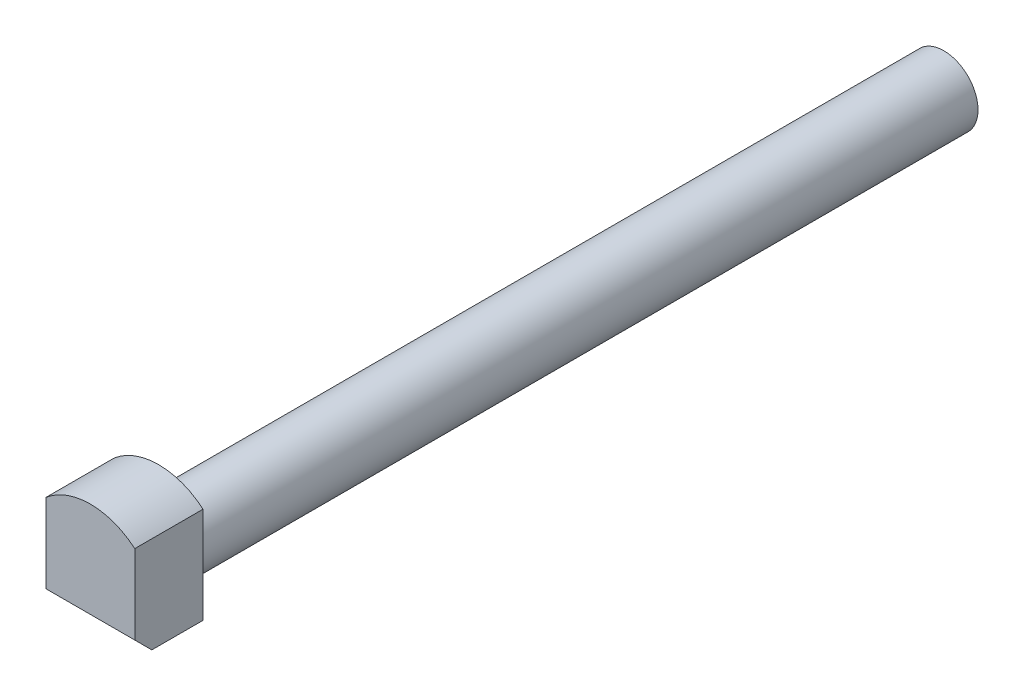
ISO-10303-21;
HEADER;
FILE_DESCRIPTION(('STEP AP214'),'2;1');
FILE_NAME('part.step','',(''),(''),'','','');
FILE_SCHEMA(('AUTOMOTIVE_DESIGN { 1 0 10303 214 1 1 1 1 }'));
ENDSEC;
DATA;
#1=APPLICATION_CONTEXT('core data for automotive mechanical design processes');
#2=APPLICATION_PROTOCOL_DEFINITION('international standard','automotive_design',2000,#1);
#3=PRODUCT_CONTEXT('',#1,'mechanical');
#4=PRODUCT('Part','Part','',(#3));
#5=PRODUCT_RELATED_PRODUCT_CATEGORY('part','',(#4));
#6=PRODUCT_DEFINITION_FORMATION('','',#4);
#7=PRODUCT_DEFINITION_CONTEXT('part definition',#1,'design');
#8=PRODUCT_DEFINITION('design','',#6,#7);
#9=PRODUCT_DEFINITION_SHAPE('','',#8);
#10=(LENGTH_UNIT() NAMED_UNIT(*) SI_UNIT(.MILLI.,.METRE.));
#11=(NAMED_UNIT(*) PLANE_ANGLE_UNIT() SI_UNIT($,.RADIAN.));
#12=(NAMED_UNIT(*) SI_UNIT($,.STERADIAN.) SOLID_ANGLE_UNIT());
#13=UNCERTAINTY_MEASURE_WITH_UNIT(LENGTH_MEASURE(1.E-05),#10,'distance_accuracy_value','');
#14=(GEOMETRIC_REPRESENTATION_CONTEXT(3) GLOBAL_UNCERTAINTY_ASSIGNED_CONTEXT((#13)) GLOBAL_UNIT_ASSIGNED_CONTEXT((#10,
#11,#12)) REPRESENTATION_CONTEXT('',''));
#15=CARTESIAN_POINT('',(0.,0.,0.));
#16=DIRECTION('',(0.,0.,1.));
#17=DIRECTION('',(1.,0.,0.));
#18=AXIS2_PLACEMENT_3D('',#15,#16,#17);
#19=CARTESIAN_POINT('',(0.,1.35,-13.8284271247462));
#20=DIRECTION('',(0.,0.,1.));
#21=DIRECTION('',(1.,0.,0.));
#22=AXIS2_PLACEMENT_3D('',#19,#20,#21);
#23=CYLINDRICAL_SURFACE('',#22,1.);
#24=CARTESIAN_POINT('',(0.,1.35,16.5));
#25=DIRECTION('',(0.,0.,1.));
#26=DIRECTION('',(1.,0.,0.));
#27=AXIS2_PLACEMENT_3D('',#24,#25,#26);
#28=CIRCLE('',#27,1.);
#29=CARTESIAN_POINT('',(1.,1.35,16.5));
#30=VERTEX_POINT('',#29);
#31=EDGE_CURVE('E108',#30,#30,#28,.T.);
#32=ORIENTED_EDGE('',*,*,#31,.F.);
#33=EDGE_LOOP('',(#32));
#34=FACE_BOUND('',#33,.T.);
#35=CARTESIAN_POINT('',(0.,1.35,-6.5));
#36=DIRECTION('',(0.,0.,-1.));
#37=DIRECTION('',(-1.,0.,0.));
#38=AXIS2_PLACEMENT_3D('',#35,#36,#37);
#39=CIRCLE('',#38,1.);
#40=CARTESIAN_POINT('',(-1.,1.35,-6.5));
#41=VERTEX_POINT('',#40);
#42=EDGE_CURVE('E134',#41,#41,#39,.T.);
#43=ORIENTED_EDGE('',*,*,#42,.F.);
#44=EDGE_LOOP('',(#43));
#45=FACE_BOUND('',#44,.T.);
#46=ADVANCED_FACE('F36',(#34,#45),#23,.T.);
#47=CARTESIAN_POINT('',(0.,1.35,18.5));
#48=DIRECTION('',(0.,0.,-1.));
#49=DIRECTION('',(-1.,0.,0.));
#50=AXIS2_PLACEMENT_3D('',#47,#48,#49);
#51=CYLINDRICAL_SURFACE('',#50,2.);
#52=DIRECTION('',(0.,0.,1.));
#53=VECTOR('',#52,1.);
#54=CARTESIAN_POINT('',(1.3,2.86986841535707,-11.));
#55=LINE('',#54,#53);
#56=CARTESIAN_POINT('',(1.3,2.86986841535707,16.5));
#57=VERTEX_POINT('',#56);
#58=CARTESIAN_POINT('',(1.3,2.86986841535707,18.5));
#59=VERTEX_POINT('',#58);
#60=EDGE_CURVE('E96',#57,#59,#55,.T.);
#61=ORIENTED_EDGE('',*,*,#60,.F.);
#62=CARTESIAN_POINT('',(0.,1.35,16.5));
#63=DIRECTION('',(0.,0.,1.));
#64=DIRECTION('',(1.,0.,0.));
#65=AXIS2_PLACEMENT_3D('',#62,#63,#64);
#66=CIRCLE('',#65,2.);
#67=CARTESIAN_POINT('',(-1.3,2.86986841535707,16.5));
#68=VERTEX_POINT('',#67);
#69=EDGE_CURVE('E103',#57,#68,#66,.T.);
#70=ORIENTED_EDGE('',*,*,#69,.T.);
#71=DIRECTION('',(0.,0.,1.));
#72=VECTOR('',#71,1.);
#73=CARTESIAN_POINT('',(-1.3,2.86986841535707,-11.));
#74=LINE('',#73,#72);
#75=CARTESIAN_POINT('',(-1.3,2.86986841535707,18.5));
#76=VERTEX_POINT('',#75);
#77=EDGE_CURVE('E92',#68,#76,#74,.T.);
#78=ORIENTED_EDGE('',*,*,#77,.T.);
#79=CARTESIAN_POINT('',(0.,1.35,18.5));
#80=DIRECTION('',(0.,0.,1.));
#81=DIRECTION('',(1.,0.,0.));
#82=AXIS2_PLACEMENT_3D('',#79,#80,#81);
#83=CIRCLE('',#82,2.);
#84=EDGE_CURVE('E89',#59,#76,#83,.T.);
#85=ORIENTED_EDGE('',*,*,#84,.F.);
#86=EDGE_LOOP('',(#61,#70,#78,#85));
#87=FACE_BOUND('',#86,.T.);
#88=ADVANCED_FACE('F107',(#87),#51,.T.);
#89=CARTESIAN_POINT('',(0.,1.35,18.5));
#90=DIRECTION('',(0.,0.,1.));
#91=DIRECTION('',(1.,0.,0.));
#92=AXIS2_PLACEMENT_3D('',#89,#90,#91);
#93=PLANE('',#92);
#94=DIRECTION('',(0.,-1.,0.));
#95=VECTOR('',#94,1.);
#96=CARTESIAN_POINT('',(-1.3,2.86986841535707,18.5));
#97=LINE('',#96,#95);
#98=CARTESIAN_POINT('',(-1.3,0.55,18.5));
#99=VERTEX_POINT('',#98);
#100=EDGE_CURVE('E93',#76,#99,#97,.T.);
#101=ORIENTED_EDGE('',*,*,#100,.T.);
#102=DIRECTION('',(1.,0.,0.));
#103=VECTOR('',#102,1.);
#104=CARTESIAN_POINT('',(0.,0.55,18.5));
#105=LINE('',#104,#103);
#106=CARTESIAN_POINT('',(1.3,0.55,18.5));
#107=VERTEX_POINT('',#106);
#108=EDGE_CURVE('E91',#99,#107,#105,.T.);
#109=ORIENTED_EDGE('',*,*,#108,.T.);
#110=DIRECTION('',(0.,1.,0.));
#111=VECTOR('',#110,1.);
#112=CARTESIAN_POINT('',(1.3,2.86986841535707,18.5));
#113=LINE('',#112,#111);
#114=EDGE_CURVE('E84',#107,#59,#113,.T.);
#115=ORIENTED_EDGE('',*,*,#114,.T.);
#116=ORIENTED_EDGE('',*,*,#84,.T.);
#117=EDGE_LOOP('',(#101,#109,#115,#116));
#118=FACE_BOUND('',#117,.T.);
#119=ADVANCED_FACE('F87',(#118),#93,.T.);
#120=CARTESIAN_POINT('',(0.,1.35,16.5));
#121=DIRECTION('',(0.,0.,1.));
#122=DIRECTION('',(1.,0.,0.));
#123=AXIS2_PLACEMENT_3D('',#120,#121,#122);
#124=PLANE('',#123);
#125=ORIENTED_EDGE('',*,*,#31,.T.);
#126=EDGE_LOOP('',(#125));
#127=FACE_BOUND('',#126,.T.);
#128=DIRECTION('',(0.,1.,0.));
#129=VECTOR('',#128,1.);
#130=CARTESIAN_POINT('',(1.3,1.35,16.5));
#131=LINE('',#130,#129);
#132=CARTESIAN_POINT('',(1.3,0.0500000000000001,16.5));
#133=VERTEX_POINT('',#132);
#134=EDGE_CURVE('E99',#133,#57,#131,.T.);
#135=ORIENTED_EDGE('',*,*,#134,.F.);
#136=DIRECTION('',(1.,0.,0.));
#137=VECTOR('',#136,1.);
#138=CARTESIAN_POINT('',(0.,0.0500000000000001,16.5));
#139=LINE('',#138,#137);
#140=CARTESIAN_POINT('',(-1.3,0.0500000000000001,16.5));
#141=VERTEX_POINT('',#140);
#142=EDGE_CURVE('E118',#141,#133,#139,.T.);
#143=ORIENTED_EDGE('',*,*,#142,.F.);
#144=DIRECTION('',(0.,-1.,0.));
#145=VECTOR('',#144,1.);
#146=CARTESIAN_POINT('',(-1.3,1.35,16.5));
#147=LINE('',#146,#145);
#148=EDGE_CURVE('E111',#68,#141,#147,.T.);
#149=ORIENTED_EDGE('',*,*,#148,.F.);
#150=ORIENTED_EDGE('',*,*,#69,.F.);
#151=EDGE_LOOP('',(#135,#143,#149,#150));
#152=FACE_BOUND('',#151,.T.);
#153=ADVANCED_FACE('F128',(#127,#152),#124,.F.);
#154=CARTESIAN_POINT('',(1.3,2.86986841535707,-11.));
#155=DIRECTION('',(1.,0.,0.));
#156=DIRECTION('',(0.,1.,0.));
#157=AXIS2_PLACEMENT_3D('',#154,#155,#156);
#158=PLANE('',#157);
#159=ORIENTED_EDGE('',*,*,#114,.F.);
#160=DIRECTION('',(0.,0.707106781186547,0.707106781186548));
#161=VECTOR('',#160,1.);
#162=CARTESIAN_POINT('',(1.3,-13.0400657923215,4.90993420767852));
#163=LINE('',#162,#161);
#164=CARTESIAN_POINT('',(1.3,0.0500000000000001,18.));
#165=VERTEX_POINT('',#164);
#166=EDGE_CURVE('E59',#107,#165,#163,.F.);
#167=ORIENTED_EDGE('',*,*,#166,.T.);
#168=DIRECTION('',(0.,0.,1.));
#169=VECTOR('',#168,1.);
#170=CARTESIAN_POINT('',(1.3,0.0500000000000001,-11.));
#171=LINE('',#170,#169);
#172=EDGE_CURVE('E104',#133,#165,#171,.T.);
#173=ORIENTED_EDGE('',*,*,#172,.F.);
#174=ORIENTED_EDGE('',*,*,#134,.T.);
#175=ORIENTED_EDGE('',*,*,#60,.T.);
#176=EDGE_LOOP('',(#159,#167,#173,#174,#175));
#177=FACE_BOUND('',#176,.T.);
#178=ADVANCED_FACE('F97',(#177),#158,.T.);
#179=CARTESIAN_POINT('',(-1.3,0.0500000000000001,-11.));
#180=DIRECTION('',(0.,-1.,0.));
#181=DIRECTION('',(0.,0.,-1.));
#182=AXIS2_PLACEMENT_3D('',#179,#180,#181);
#183=PLANE('',#182);
#184=ORIENTED_EDGE('',*,*,#172,.T.);
#185=DIRECTION('',(-1.,0.,0.));
#186=VECTOR('',#185,1.);
#187=CARTESIAN_POINT('',(-1.3,0.0500000000000001,18.));
#188=LINE('',#187,#186);
#189=CARTESIAN_POINT('',(-1.3,0.0500000000000001,18.));
#190=VERTEX_POINT('',#189);
#191=EDGE_CURVE('E45',#165,#190,#188,.T.);
#192=ORIENTED_EDGE('',*,*,#191,.T.);
#193=DIRECTION('',(0.,0.,1.));
#194=VECTOR('',#193,1.);
#195=CARTESIAN_POINT('',(-1.3,0.0500000000000001,-11.));
#196=LINE('',#195,#194);
#197=EDGE_CURVE('E124',#141,#190,#196,.T.);
#198=ORIENTED_EDGE('',*,*,#197,.F.);
#199=ORIENTED_EDGE('',*,*,#142,.T.);
#200=EDGE_LOOP('',(#184,#192,#198,#199));
#201=FACE_BOUND('',#200,.T.);
#202=ADVANCED_FACE('F123',(#201),#183,.T.);
#203=CARTESIAN_POINT('',(-1.3,2.86986841535707,-11.));
#204=DIRECTION('',(-1.,0.,0.));
#205=DIRECTION('',(0.,-1.,0.));
#206=AXIS2_PLACEMENT_3D('',#203,#204,#205);
#207=PLANE('',#206);
#208=ORIENTED_EDGE('',*,*,#197,.T.);
#209=DIRECTION('',(0.,-0.707106781186547,-0.707106781186548));
#210=VECTOR('',#209,1.);
#211=CARTESIAN_POINT('',(-1.3,-13.0400657923215,4.90993420767852));
#212=LINE('',#211,#210);
#213=EDGE_CURVE('E12',#190,#99,#212,.F.);
#214=ORIENTED_EDGE('',*,*,#213,.T.);
#215=ORIENTED_EDGE('',*,*,#100,.F.);
#216=ORIENTED_EDGE('',*,*,#77,.F.);
#217=ORIENTED_EDGE('',*,*,#148,.T.);
#218=EDGE_LOOP('',(#208,#214,#215,#216,#217));
#219=FACE_BOUND('',#218,.T.);
#220=ADVANCED_FACE('F130',(#219),#207,.T.);
#221=CARTESIAN_POINT('',(0.,0.55,18.5));
#222=DIRECTION('',(0.,0.707106781186548,-0.707106781186547));
#223=DIRECTION('',(1.,0.,0.));
#224=AXIS2_PLACEMENT_3D('',#221,#222,#223);
#225=PLANE('',#224);
#226=ORIENTED_EDGE('',*,*,#213,.F.);
#227=ORIENTED_EDGE('',*,*,#191,.F.);
#228=ORIENTED_EDGE('',*,*,#166,.F.);
#229=ORIENTED_EDGE('',*,*,#108,.F.);
#230=EDGE_LOOP('',(#226,#227,#228,#229));
#231=FACE_BOUND('',#230,.T.);
#232=ADVANCED_FACE('F39',(#231),#225,.F.);
#233=CARTESIAN_POINT('',(0.,1.35,-6.5));
#234=DIRECTION('',(0.,0.,-1.));
#235=DIRECTION('',(-1.,0.,0.));
#236=AXIS2_PLACEMENT_3D('',#233,#234,#235);
#237=PLANE('',#236);
#238=ORIENTED_EDGE('',*,*,#42,.T.);
#239=EDGE_LOOP('',(#238));
#240=FACE_BOUND('',#239,.T.);
#241=ADVANCED_FACE('F138',(#240),#237,.T.);
#242=CLOSED_SHELL('',(#46,#88,#119,#153,#178,#202,#220,#232,#241));
#243=MANIFOLD_SOLID_BREP('B2',#242);
#244=ADVANCED_BREP_SHAPE_REPRESENTATION('',(#18,#243),#14);
#245=SHAPE_DEFINITION_REPRESENTATION(#9,#244);
ENDSEC;
END-ISO-10303-21;
